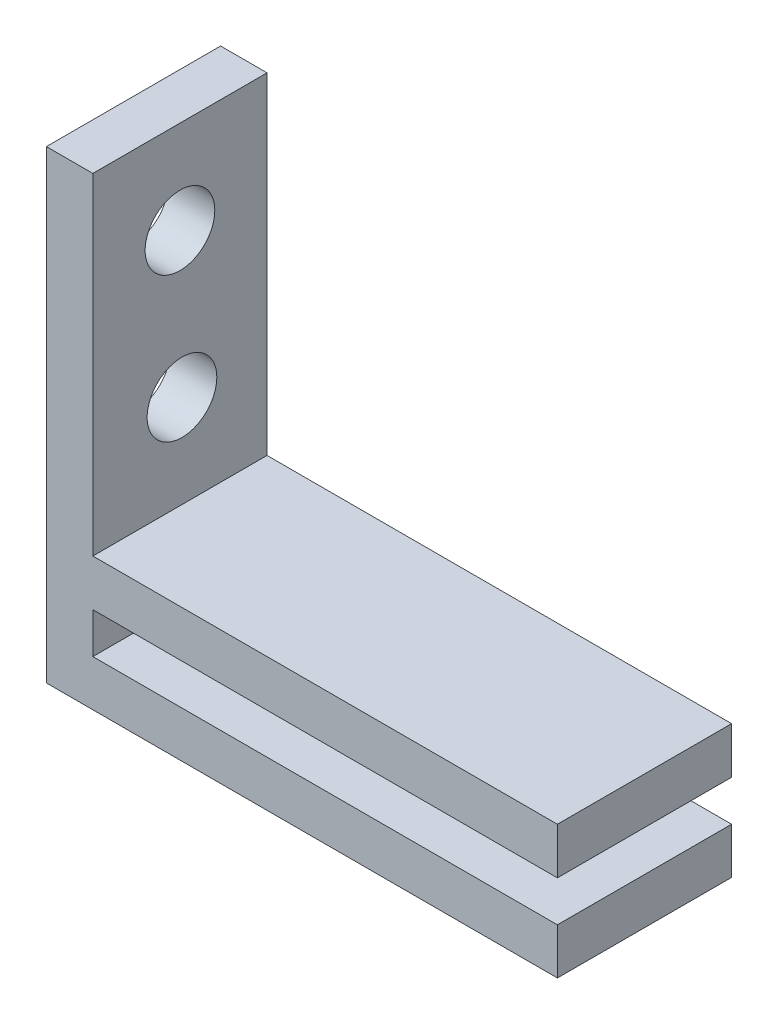
ISO-10303-21;
HEADER;
FILE_DESCRIPTION(('STEP AP214'),'2;1');
FILE_NAME('part.step','',(''),(''),'','','');
FILE_SCHEMA(('AUTOMOTIVE_DESIGN { 1 0 10303 214 1 1 1 1 }'));
ENDSEC;
DATA;
#1=APPLICATION_CONTEXT('core data for automotive mechanical design processes');
#2=APPLICATION_PROTOCOL_DEFINITION('international standard','automotive_design',2000,#1);
#3=PRODUCT_CONTEXT('',#1,'mechanical');
#4=PRODUCT('Part','Part','',(#3));
#5=PRODUCT_RELATED_PRODUCT_CATEGORY('part','',(#4));
#6=PRODUCT_DEFINITION_FORMATION('','',#4);
#7=PRODUCT_DEFINITION_CONTEXT('part definition',#1,'design');
#8=PRODUCT_DEFINITION('design','',#6,#7);
#9=PRODUCT_DEFINITION_SHAPE('','',#8);
#10=(LENGTH_UNIT() NAMED_UNIT(*) SI_UNIT(.MILLI.,.METRE.));
#11=(NAMED_UNIT(*) PLANE_ANGLE_UNIT() SI_UNIT($,.RADIAN.));
#12=(NAMED_UNIT(*) SI_UNIT($,.STERADIAN.) SOLID_ANGLE_UNIT());
#13=UNCERTAINTY_MEASURE_WITH_UNIT(LENGTH_MEASURE(1.E-05),#10,'distance_accuracy_value','');
#14=(GEOMETRIC_REPRESENTATION_CONTEXT(3) GLOBAL_UNCERTAINTY_ASSIGNED_CONTEXT((#13)) GLOBAL_UNIT_ASSIGNED_CONTEXT((#10,
#11,#12)) REPRESENTATION_CONTEXT('',''));
#15=CARTESIAN_POINT('',(0.,0.,0.));
#16=DIRECTION('',(0.,0.,1.));
#17=DIRECTION('',(1.,0.,0.));
#18=AXIS2_PLACEMENT_3D('',#15,#16,#17);
#19=CARTESIAN_POINT('',(2.,0.,0.));
#20=DIRECTION('',(1.,0.,0.));
#21=DIRECTION('',(0.,0.,-1.));
#22=AXIS2_PLACEMENT_3D('',#19,#20,#21);
#23=PLANE('',#22);
#24=DIRECTION('',(0.,1.,0.));
#25=VECTOR('',#24,1.);
#26=CARTESIAN_POINT('',(2.,9.02439024390244,-6.7595818815331));
#27=LINE('',#26,#25);
#28=CARTESIAN_POINT('',(2.,-8.99213043612717,-6.7595818815331));
#29=VERTEX_POINT('',#28);
#30=CARTESIAN_POINT('',(2.,-7.24213043612718,-6.7595818815331));
#31=VERTEX_POINT('',#30);
#32=EDGE_CURVE('E204',#29,#31,#27,.T.);
#33=ORIENTED_EDGE('',*,*,#32,.T.);
#34=DIRECTION('',(0.,0.,-1.));
#35=VECTOR('',#34,1.);
#36=CARTESIAN_POINT('',(2.,-7.24213043612717,0.));
#37=LINE('',#36,#35);
#38=CARTESIAN_POINT('',(2.,-7.24213043612718,0.740418118466897));
#39=VERTEX_POINT('',#38);
#40=EDGE_CURVE('E62',#39,#31,#37,.T.);
#41=ORIENTED_EDGE('',*,*,#40,.F.);
#42=DIRECTION('',(0.,-1.,0.));
#43=VECTOR('',#42,1.);
#44=CARTESIAN_POINT('',(2.,9.02439024390244,0.740418118466899));
#45=LINE('',#44,#43);
#46=CARTESIAN_POINT('',(2.,-8.99213043612717,0.740418118466897));
#47=VERTEX_POINT('',#46);
#48=EDGE_CURVE('E203',#39,#47,#45,.T.);
#49=ORIENTED_EDGE('',*,*,#48,.T.);
#50=DIRECTION('',(0.,0.,1.));
#51=VECTOR('',#50,1.);
#52=CARTESIAN_POINT('',(2.,-8.99213043612717,-6.7595818815331));
#53=LINE('',#52,#51);
#54=EDGE_CURVE('E134',#29,#47,#53,.T.);
#55=ORIENTED_EDGE('',*,*,#54,.F.);
#56=EDGE_LOOP('',(#33,#41,#49,#55));
#57=FACE_BOUND('',#56,.T.);
#58=ADVANCED_FACE('F44',(#57),#23,.T.);
#59=CARTESIAN_POINT('',(2.,9.02439024390244,0.740418118466899));
#60=DIRECTION('',(0.,0.,-1.));
#61=DIRECTION('',(0.,1.,0.));
#62=AXIS2_PLACEMENT_3D('',#59,#60,#61);
#63=PLANE('',#62);
#64=DIRECTION('',(0.,-1.,0.));
#65=VECTOR('',#64,1.);
#66=CARTESIAN_POINT('',(0.,9.02439024390244,0.740418118466899));
#67=LINE('',#66,#65);
#68=CARTESIAN_POINT('',(0.,9.02439024390244,0.740418118466899));
#69=VERTEX_POINT('',#68);
#70=CARTESIAN_POINT('',(0.,-10.9756097560976,0.740418118466897));
#71=VERTEX_POINT('',#70);
#72=EDGE_CURVE('E199',#69,#71,#67,.T.);
#73=ORIENTED_EDGE('',*,*,#72,.T.);
#74=DIRECTION('',(-1.,0.,0.));
#75=VECTOR('',#74,1.);
#76=CARTESIAN_POINT('',(2.,-10.9756097560976,0.740418118466897));
#77=LINE('',#76,#75);
#78=CARTESIAN_POINT('',(22.,-10.9756097560976,0.740418118466897));
#79=VERTEX_POINT('',#78);
#80=EDGE_CURVE('E11',#79,#71,#77,.T.);
#81=ORIENTED_EDGE('',*,*,#80,.F.);
#82=DIRECTION('',(0.,-1.,0.));
#83=VECTOR('',#82,1.);
#84=CARTESIAN_POINT('',(22.,-10.9756097560976,0.740418118466897));
#85=LINE('',#84,#83);
#86=CARTESIAN_POINT('',(22.,-8.99213043612717,0.740418118466897));
#87=VERTEX_POINT('',#86);
#88=EDGE_CURVE('E180',#87,#79,#85,.T.);
#89=ORIENTED_EDGE('',*,*,#88,.F.);
#90=DIRECTION('',(-1.,0.,0.));
#91=VECTOR('',#90,1.);
#92=CARTESIAN_POINT('',(22.,-8.99213043612717,0.740418118466897));
#93=LINE('',#92,#91);
#94=EDGE_CURVE('E188',#87,#47,#93,.T.);
#95=ORIENTED_EDGE('',*,*,#94,.T.);
#96=ORIENTED_EDGE('',*,*,#48,.F.);
#97=DIRECTION('',(-1.,0.,0.));
#98=VECTOR('',#97,1.);
#99=CARTESIAN_POINT('',(22.,-7.24213043612717,0.740418118466897));
#100=LINE('',#99,#98);
#101=CARTESIAN_POINT('',(22.,-7.24213043612717,0.740418118466897));
#102=VERTEX_POINT('',#101);
#103=EDGE_CURVE('E135',#102,#39,#100,.T.);
#104=ORIENTED_EDGE('',*,*,#103,.F.);
#105=DIRECTION('',(0.,-1.,0.));
#106=VECTOR('',#105,1.);
#107=CARTESIAN_POINT('',(22.,0.,0.740418118466898));
#108=LINE('',#107,#106);
#109=CARTESIAN_POINT('',(22.,-5.24213043612717,0.740418118466897));
#110=VERTEX_POINT('',#109);
#111=EDGE_CURVE('E138',#110,#102,#108,.T.);
#112=ORIENTED_EDGE('',*,*,#111,.F.);
#113=DIRECTION('',(-1.,0.,0.));
#114=VECTOR('',#113,1.);
#115=CARTESIAN_POINT('',(22.,-5.24213043612717,0.740418118466897));
#116=LINE('',#115,#114);
#117=CARTESIAN_POINT('',(2.,-5.24213043612717,0.740418118466897));
#118=VERTEX_POINT('',#117);
#119=EDGE_CURVE('E125',#110,#118,#116,.T.);
#120=ORIENTED_EDGE('',*,*,#119,.T.);
#121=CARTESIAN_POINT('',(2.,9.02439024390244,0.740418118466899));
#122=VERTEX_POINT('',#121);
#123=EDGE_CURVE('E70',#122,#118,#45,.T.);
#124=ORIENTED_EDGE('',*,*,#123,.F.);
#125=DIRECTION('',(-1.,0.,0.));
#126=VECTOR('',#125,1.);
#127=CARTESIAN_POINT('',(2.,9.02439024390244,0.740418118466899));
#128=LINE('',#127,#126);
#129=EDGE_CURVE('E210',#122,#69,#128,.T.);
#130=ORIENTED_EDGE('',*,*,#129,.T.);
#131=EDGE_LOOP('',(#73,#81,#89,#95,#96,#104,#112,#120,#124,#130));
#132=FACE_BOUND('',#131,.T.);
#133=ADVANCED_FACE('F46',(#132),#63,.F.);
#134=CARTESIAN_POINT('',(2.,-10.9756097560976,0.740418118466897));
#135=DIRECTION('',(0.,1.,0.));
#136=DIRECTION('',(0.,0.,1.));
#137=AXIS2_PLACEMENT_3D('',#134,#135,#136);
#138=PLANE('',#137);
#139=DIRECTION('',(0.,0.,-1.));
#140=VECTOR('',#139,1.);
#141=CARTESIAN_POINT('',(0.,-10.9756097560976,0.740418118466897));
#142=LINE('',#141,#140);
#143=CARTESIAN_POINT('',(0.,-10.9756097560976,-6.7595818815331));
#144=VERTEX_POINT('',#143);
#145=EDGE_CURVE('E213',#71,#144,#142,.T.);
#146=ORIENTED_EDGE('',*,*,#145,.T.);
#147=DIRECTION('',(-1.,0.,0.));
#148=VECTOR('',#147,1.);
#149=CARTESIAN_POINT('',(2.,-10.9756097560976,-6.7595818815331));
#150=LINE('',#149,#148);
#151=CARTESIAN_POINT('',(22.,-10.9756097560976,-6.7595818815331));
#152=VERTEX_POINT('',#151);
#153=EDGE_CURVE('E54',#152,#144,#150,.T.);
#154=ORIENTED_EDGE('',*,*,#153,.F.);
#155=DIRECTION('',(0.,0.,-1.));
#156=VECTOR('',#155,1.);
#157=CARTESIAN_POINT('',(22.,-10.9756097560976,-6.7595818815331));
#158=LINE('',#157,#156);
#159=EDGE_CURVE('E184',#79,#152,#158,.T.);
#160=ORIENTED_EDGE('',*,*,#159,.F.);
#161=ORIENTED_EDGE('',*,*,#80,.T.);
#162=EDGE_LOOP('',(#146,#154,#160,#161));
#163=FACE_BOUND('',#162,.T.);
#164=ADVANCED_FACE('F273',(#163),#138,.F.);
#165=CARTESIAN_POINT('',(2.,9.02439024390244,-6.7595818815331));
#166=DIRECTION('',(0.,0.,1.));
#167=DIRECTION('',(1.,0.,0.));
#168=AXIS2_PLACEMENT_3D('',#165,#166,#167);
#169=PLANE('',#168);
#170=DIRECTION('',(0.,1.,0.));
#171=VECTOR('',#170,1.);
#172=CARTESIAN_POINT('',(0.,9.02439024390244,-6.7595818815331));
#173=LINE('',#172,#171);
#174=CARTESIAN_POINT('',(0.,9.02439024390244,-6.7595818815331));
#175=VERTEX_POINT('',#174);
#176=EDGE_CURVE('E216',#144,#175,#173,.T.);
#177=ORIENTED_EDGE('',*,*,#176,.T.);
#178=DIRECTION('',(-1.,0.,0.));
#179=VECTOR('',#178,1.);
#180=CARTESIAN_POINT('',(2.,9.02439024390244,-6.7595818815331));
#181=LINE('',#180,#179);
#182=CARTESIAN_POINT('',(2.,9.02439024390244,-6.7595818815331));
#183=VERTEX_POINT('',#182);
#184=EDGE_CURVE('E225',#183,#175,#181,.T.);
#185=ORIENTED_EDGE('',*,*,#184,.F.);
#186=CARTESIAN_POINT('',(2.,-5.24213043612717,-6.7595818815331));
#187=VERTEX_POINT('',#186);
#188=EDGE_CURVE('E202',#187,#183,#27,.T.);
#189=ORIENTED_EDGE('',*,*,#188,.F.);
#190=DIRECTION('',(-1.,0.,0.));
#191=VECTOR('',#190,1.);
#192=CARTESIAN_POINT('',(22.,-5.24213043612717,-6.7595818815331));
#193=LINE('',#192,#191);
#194=CARTESIAN_POINT('',(22.,-5.24213043612717,-6.7595818815331));
#195=VERTEX_POINT('',#194);
#196=EDGE_CURVE('E162',#195,#187,#193,.T.);
#197=ORIENTED_EDGE('',*,*,#196,.F.);
#198=DIRECTION('',(0.,1.,0.));
#199=VECTOR('',#198,1.);
#200=CARTESIAN_POINT('',(22.,0.,-6.7595818815331));
#201=LINE('',#200,#199);
#202=CARTESIAN_POINT('',(22.,-7.24213043612717,-6.7595818815331));
#203=VERTEX_POINT('',#202);
#204=EDGE_CURVE('E148',#203,#195,#201,.T.);
#205=ORIENTED_EDGE('',*,*,#204,.F.);
#206=DIRECTION('',(-1.,0.,0.));
#207=VECTOR('',#206,1.);
#208=CARTESIAN_POINT('',(22.,-7.24213043612717,-6.7595818815331));
#209=LINE('',#208,#207);
#210=EDGE_CURVE('E167',#203,#31,#209,.T.);
#211=ORIENTED_EDGE('',*,*,#210,.T.);
#212=ORIENTED_EDGE('',*,*,#32,.F.);
#213=DIRECTION('',(-1.,0.,0.));
#214=VECTOR('',#213,1.);
#215=CARTESIAN_POINT('',(22.,-8.99213043612717,-6.7595818815331));
#216=LINE('',#215,#214);
#217=CARTESIAN_POINT('',(22.,-8.99213043612717,-6.7595818815331));
#218=VERTEX_POINT('',#217);
#219=EDGE_CURVE('E195',#218,#29,#216,.T.);
#220=ORIENTED_EDGE('',*,*,#219,.F.);
#221=DIRECTION('',(0.,1.,0.));
#222=VECTOR('',#221,1.);
#223=CARTESIAN_POINT('',(22.,-10.9756097560976,-6.7595818815331));
#224=LINE('',#223,#222);
#225=EDGE_CURVE('E173',#152,#218,#224,.T.);
#226=ORIENTED_EDGE('',*,*,#225,.F.);
#227=ORIENTED_EDGE('',*,*,#153,.T.);
#228=EDGE_LOOP('',(#177,#185,#189,#197,#205,#211,#212,#220,#226,#227));
#229=FACE_BOUND('',#228,.T.);
#230=ADVANCED_FACE('F258',(#229),#169,.F.);
#231=CARTESIAN_POINT('',(2.,9.02439024390244,0.740418118466899));
#232=DIRECTION('',(0.,-1.,0.));
#233=DIRECTION('',(0.,0.,-1.));
#234=AXIS2_PLACEMENT_3D('',#231,#232,#233);
#235=PLANE('',#234);
#236=DIRECTION('',(0.,0.,1.));
#237=VECTOR('',#236,1.);
#238=CARTESIAN_POINT('',(0.,9.02439024390244,0.740418118466899));
#239=LINE('',#238,#237);
#240=EDGE_CURVE('E219',#175,#69,#239,.T.);
#241=ORIENTED_EDGE('',*,*,#240,.T.);
#242=ORIENTED_EDGE('',*,*,#129,.F.);
#243=DIRECTION('',(0.,0.,1.));
#244=VECTOR('',#243,1.);
#245=CARTESIAN_POINT('',(2.,9.02439024390244,0.740418118466899));
#246=LINE('',#245,#244);
#247=EDGE_CURVE('E207',#183,#122,#246,.T.);
#248=ORIENTED_EDGE('',*,*,#247,.F.);
#249=ORIENTED_EDGE('',*,*,#184,.T.);
#250=EDGE_LOOP('',(#241,#242,#248,#249));
#251=FACE_BOUND('',#250,.T.);
#252=ADVANCED_FACE('F253',(#251),#235,.F.);
#253=CARTESIAN_POINT('',(2.,5.02439024390244,-3.0095818815331));
#254=DIRECTION('',(1.,0.,0.));
#255=DIRECTION('',(0.,0.,-1.));
#256=AXIS2_PLACEMENT_3D('',#253,#254,#255);
#257=CIRCLE('',#256,1.5);
#258=CARTESIAN_POINT('',(2.,5.02439024390244,-4.5095818815331));
#259=VERTEX_POINT('',#258);
#260=EDGE_CURVE('E234',#259,#259,#257,.T.);
#261=ORIENTED_EDGE('',*,*,#260,.F.);
#262=EDGE_LOOP('',(#261));
#263=FACE_BOUND('',#262,.T.);
#264=CARTESIAN_POINT('',(2.,-1.24213043612717,-3.09645831879379));
#265=DIRECTION('',(1.,0.,0.));
#266=DIRECTION('',(0.,0.,-1.));
#267=AXIS2_PLACEMENT_3D('',#264,#265,#266);
#268=CIRCLE('',#267,1.5);
#269=CARTESIAN_POINT('',(2.,-1.24213043612717,-4.59645831879379));
#270=VERTEX_POINT('',#269);
#271=EDGE_CURVE('E155',#270,#270,#268,.T.);
#272=ORIENTED_EDGE('',*,*,#271,.F.);
#273=EDGE_LOOP('',(#272));
#274=FACE_BOUND('',#273,.T.);
#275=DIRECTION('',(0.,0.,-1.));
#276=VECTOR('',#275,1.);
#277=CARTESIAN_POINT('',(2.,-5.24213043612717,0.));
#278=LINE('',#277,#276);
#279=EDGE_CURVE('E131',#118,#187,#278,.T.);
#280=ORIENTED_EDGE('',*,*,#279,.T.);
#281=ORIENTED_EDGE('',*,*,#188,.T.);
#282=ORIENTED_EDGE('',*,*,#247,.T.);
#283=ORIENTED_EDGE('',*,*,#123,.T.);
#284=EDGE_LOOP('',(#280,#281,#282,#283));
#285=FACE_BOUND('',#284,.T.);
#286=ADVANCED_FACE('F250',(#263,#274,#285),#23,.T.);
#287=CARTESIAN_POINT('',(0.,0.,0.));
#288=DIRECTION('',(1.,0.,0.));
#289=DIRECTION('',(0.,0.,-1.));
#290=AXIS2_PLACEMENT_3D('',#287,#288,#289);
#291=PLANE('',#290);
#292=CARTESIAN_POINT('',(0.,5.02439024390244,-3.0095818815331));
#293=DIRECTION('',(1.,0.,0.));
#294=DIRECTION('',(0.,0.,-1.));
#295=AXIS2_PLACEMENT_3D('',#292,#293,#294);
#296=CIRCLE('',#295,1.5);
#297=CARTESIAN_POINT('',(0.,5.02439024390244,-4.5095818815331));
#298=VERTEX_POINT('',#297);
#299=EDGE_CURVE('E48',#298,#298,#296,.T.);
#300=ORIENTED_EDGE('',*,*,#299,.T.);
#301=EDGE_LOOP('',(#300));
#302=FACE_BOUND('',#301,.T.);
#303=CARTESIAN_POINT('',(0.,-1.24213043612717,-3.09645831879379));
#304=DIRECTION('',(1.,0.,0.));
#305=DIRECTION('',(0.,0.,-1.));
#306=AXIS2_PLACEMENT_3D('',#303,#304,#305);
#307=CIRCLE('',#306,1.5);
#308=CARTESIAN_POINT('',(0.,-1.24213043612717,-4.59645831879379));
#309=VERTEX_POINT('',#308);
#310=EDGE_CURVE('E231',#309,#309,#307,.T.);
#311=ORIENTED_EDGE('',*,*,#310,.T.);
#312=EDGE_LOOP('',(#311));
#313=FACE_BOUND('',#312,.T.);
#314=ORIENTED_EDGE('',*,*,#72,.F.);
#315=ORIENTED_EDGE('',*,*,#240,.F.);
#316=ORIENTED_EDGE('',*,*,#176,.F.);
#317=ORIENTED_EDGE('',*,*,#145,.F.);
#318=EDGE_LOOP('',(#314,#315,#316,#317));
#319=FACE_BOUND('',#318,.T.);
#320=ADVANCED_FACE('F252',(#302,#313,#319),#291,.F.);
#321=CARTESIAN_POINT('',(22.,-8.99213043612717,-6.7595818815331));
#322=DIRECTION('',(0.,-1.,0.));
#323=DIRECTION('',(0.,0.,-1.));
#324=AXIS2_PLACEMENT_3D('',#321,#322,#323);
#325=PLANE('',#324);
#326=ORIENTED_EDGE('',*,*,#54,.T.);
#327=ORIENTED_EDGE('',*,*,#94,.F.);
#328=DIRECTION('',(0.,0.,1.));
#329=VECTOR('',#328,1.);
#330=CARTESIAN_POINT('',(22.,-8.99213043612717,-6.7595818815331));
#331=LINE('',#330,#329);
#332=EDGE_CURVE('E177',#218,#87,#331,.T.);
#333=ORIENTED_EDGE('',*,*,#332,.F.);
#334=ORIENTED_EDGE('',*,*,#219,.T.);
#335=EDGE_LOOP('',(#326,#327,#333,#334));
#336=FACE_BOUND('',#335,.T.);
#337=ADVANCED_FACE('F265',(#336),#325,.F.);
#338=CARTESIAN_POINT('',(22.,0.,0.));
#339=DIRECTION('',(1.,0.,0.));
#340=DIRECTION('',(0.,0.,-1.));
#341=AXIS2_PLACEMENT_3D('',#338,#339,#340);
#342=PLANE('',#341);
#343=ORIENTED_EDGE('',*,*,#225,.T.);
#344=ORIENTED_EDGE('',*,*,#332,.T.);
#345=ORIENTED_EDGE('',*,*,#88,.T.);
#346=ORIENTED_EDGE('',*,*,#159,.T.);
#347=EDGE_LOOP('',(#343,#344,#345,#346));
#348=FACE_BOUND('',#347,.T.);
#349=ADVANCED_FACE('F270',(#348),#342,.T.);
#350=CARTESIAN_POINT('',(22.,-5.24213043612717,0.));
#351=DIRECTION('',(0.,1.,0.));
#352=DIRECTION('',(0.,0.,1.));
#353=AXIS2_PLACEMENT_3D('',#350,#351,#352);
#354=PLANE('',#353);
#355=ORIENTED_EDGE('',*,*,#279,.F.);
#356=ORIENTED_EDGE('',*,*,#119,.F.);
#357=DIRECTION('',(0.,0.,-1.));
#358=VECTOR('',#357,1.);
#359=CARTESIAN_POINT('',(22.,-5.24213043612717,0.));
#360=LINE('',#359,#358);
#361=EDGE_CURVE('E130',#110,#195,#360,.T.);
#362=ORIENTED_EDGE('',*,*,#361,.T.);
#363=ORIENTED_EDGE('',*,*,#196,.T.);
#364=EDGE_LOOP('',(#355,#356,#362,#363));
#365=FACE_BOUND('',#364,.T.);
#366=ADVANCED_FACE('F127',(#365),#354,.T.);
#367=CARTESIAN_POINT('',(22.,-7.24213043612717,0.));
#368=DIRECTION('',(0.,1.,0.));
#369=DIRECTION('',(0.,0.,1.));
#370=AXIS2_PLACEMENT_3D('',#367,#368,#369);
#371=PLANE('',#370);
#372=ORIENTED_EDGE('',*,*,#40,.T.);
#373=ORIENTED_EDGE('',*,*,#210,.F.);
#374=DIRECTION('',(0.,0.,-1.));
#375=VECTOR('',#374,1.);
#376=CARTESIAN_POINT('',(22.,-7.24213043612717,0.));
#377=LINE('',#376,#375);
#378=EDGE_CURVE('E144',#102,#203,#377,.T.);
#379=ORIENTED_EDGE('',*,*,#378,.F.);
#380=ORIENTED_EDGE('',*,*,#103,.T.);
#381=EDGE_LOOP('',(#372,#373,#379,#380));
#382=FACE_BOUND('',#381,.T.);
#383=ADVANCED_FACE('F312',(#382),#371,.F.);
#384=CARTESIAN_POINT('',(22.,0.,0.));
#385=DIRECTION('',(1.,0.,0.));
#386=DIRECTION('',(0.,0.,-1.));
#387=AXIS2_PLACEMENT_3D('',#384,#385,#386);
#388=PLANE('',#387);
#389=ORIENTED_EDGE('',*,*,#361,.F.);
#390=ORIENTED_EDGE('',*,*,#111,.T.);
#391=ORIENTED_EDGE('',*,*,#378,.T.);
#392=ORIENTED_EDGE('',*,*,#204,.T.);
#393=EDGE_LOOP('',(#389,#390,#391,#392));
#394=FACE_BOUND('',#393,.T.);
#395=ADVANCED_FACE('F146',(#394),#388,.T.);
#396=CARTESIAN_POINT('',(-18.,-1.24213043612717,-3.09645831879379));
#397=DIRECTION('',(1.,0.,0.));
#398=DIRECTION('',(0.,0.,-1.));
#399=AXIS2_PLACEMENT_3D('',#396,#397,#398);
#400=CYLINDRICAL_SURFACE('',#399,1.5);
#401=ORIENTED_EDGE('',*,*,#271,.T.);
#402=EDGE_LOOP('',(#401));
#403=FACE_BOUND('',#402,.T.);
#404=ORIENTED_EDGE('',*,*,#310,.F.);
#405=EDGE_LOOP('',(#404));
#406=FACE_BOUND('',#405,.T.);
#407=ADVANCED_FACE('F247',(#403,#406),#400,.F.);
#408=CARTESIAN_POINT('',(-18.,5.02439024390244,-3.0095818815331));
#409=DIRECTION('',(1.,0.,0.));
#410=DIRECTION('',(0.,0.,-1.));
#411=AXIS2_PLACEMENT_3D('',#408,#409,#410);
#412=CYLINDRICAL_SURFACE('',#411,1.5);
#413=ORIENTED_EDGE('',*,*,#260,.T.);
#414=EDGE_LOOP('',(#413));
#415=FACE_BOUND('',#414,.T.);
#416=ORIENTED_EDGE('',*,*,#299,.F.);
#417=EDGE_LOOP('',(#416));
#418=FACE_BOUND('',#417,.T.);
#419=ADVANCED_FACE('F302',(#415,#418),#412,.F.);
#420=CLOSED_SHELL('',(#58,#133,#164,#230,#252,#286,#320,#337,#349,#366,#383,#395,#407,#419));
#421=MANIFOLD_SOLID_BREP('B2',#420);
#422=ADVANCED_BREP_SHAPE_REPRESENTATION('',(#18,#421),#14);
#423=SHAPE_DEFINITION_REPRESENTATION(#9,#422);
ENDSEC;
END-ISO-10303-21;
